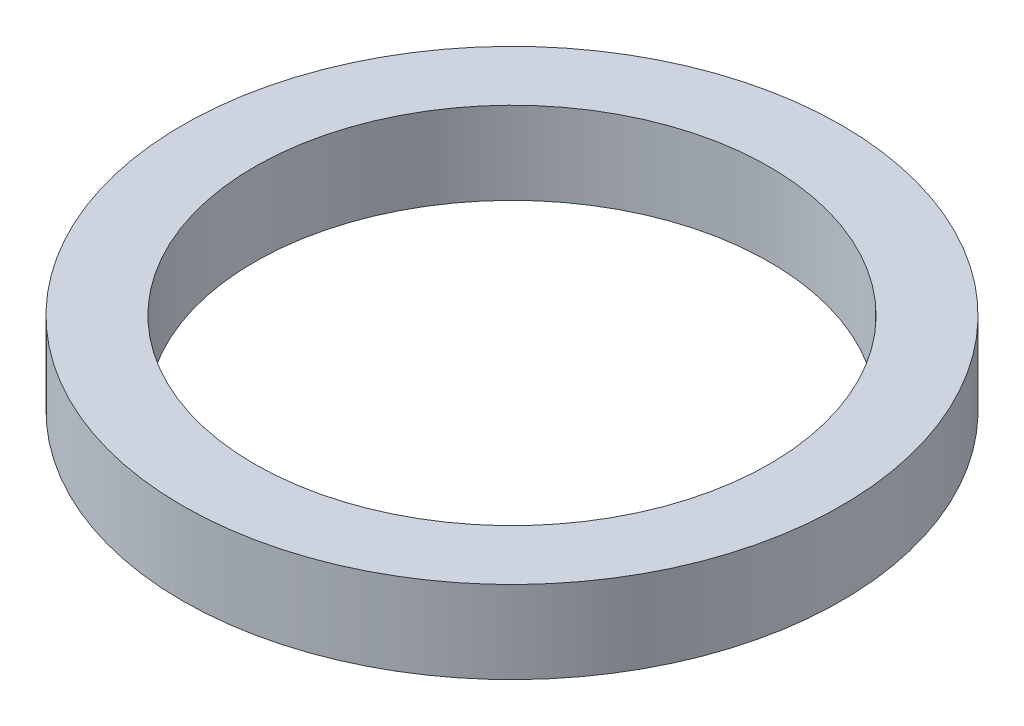
ISO-10303-21;
HEADER;
FILE_DESCRIPTION(('STEP AP214'),'2;1');
FILE_NAME('part.step','',(''),(''),'','','');
FILE_SCHEMA(('AUTOMOTIVE_DESIGN { 1 0 10303 214 1 1 1 1 }'));
ENDSEC;
DATA;
#1=APPLICATION_CONTEXT('core data for automotive mechanical design processes');
#2=APPLICATION_PROTOCOL_DEFINITION('international standard','automotive_design',2000,#1);
#3=PRODUCT_CONTEXT('',#1,'mechanical');
#4=PRODUCT('Part','Part','',(#3));
#5=PRODUCT_RELATED_PRODUCT_CATEGORY('part','',(#4));
#6=PRODUCT_DEFINITION_FORMATION('','',#4);
#7=PRODUCT_DEFINITION_CONTEXT('part definition',#1,'design');
#8=PRODUCT_DEFINITION('design','',#6,#7);
#9=PRODUCT_DEFINITION_SHAPE('','',#8);
#10=(LENGTH_UNIT() NAMED_UNIT(*) SI_UNIT(.MILLI.,.METRE.));
#11=(NAMED_UNIT(*) PLANE_ANGLE_UNIT() SI_UNIT($,.RADIAN.));
#12=(NAMED_UNIT(*) SI_UNIT($,.STERADIAN.) SOLID_ANGLE_UNIT());
#13=UNCERTAINTY_MEASURE_WITH_UNIT(LENGTH_MEASURE(1.E-05),#10,'distance_accuracy_value','');
#14=(GEOMETRIC_REPRESENTATION_CONTEXT(3) GLOBAL_UNCERTAINTY_ASSIGNED_CONTEXT((#13)) GLOBAL_UNIT_ASSIGNED_CONTEXT((#10,
#11,#12)) REPRESENTATION_CONTEXT('',''));
#15=CARTESIAN_POINT('',(0.,0.,0.));
#16=DIRECTION('',(0.,0.,1.));
#17=DIRECTION('',(1.,0.,0.));
#18=AXIS2_PLACEMENT_3D('',#15,#16,#17);
#19=CARTESIAN_POINT('',(0.,4.,0.));
#20=DIRECTION('',(0.,1.,0.));
#21=DIRECTION('',(0.,0.,1.));
#22=AXIS2_PLACEMENT_3D('',#19,#20,#21);
#23=PLANE('',#22);
#24=CARTESIAN_POINT('',(0.,4.,0.));
#25=DIRECTION('',(0.,1.,0.));
#26=DIRECTION('',(0.,0.,1.));
#27=AXIS2_PLACEMENT_3D('',#24,#25,#26);
#28=CIRCLE('',#27,16.);
#29=CARTESIAN_POINT('',(0.,4.,16.));
#30=VERTEX_POINT('',#29);
#31=EDGE_CURVE('E10',#30,#30,#28,.T.);
#32=ORIENTED_EDGE('',*,*,#31,.T.);
#33=EDGE_LOOP('',(#32));
#34=FACE_BOUND('',#33,.T.);
#35=CARTESIAN_POINT('',(0.,4.,0.));
#36=DIRECTION('',(0.,1.,0.));
#37=DIRECTION('',(0.,0.,1.));
#38=AXIS2_PLACEMENT_3D('',#35,#36,#37);
#39=CIRCLE('',#38,12.5);
#40=CARTESIAN_POINT('',(0.,4.,12.5));
#41=VERTEX_POINT('',#40);
#42=EDGE_CURVE('E46',#41,#41,#39,.T.);
#43=ORIENTED_EDGE('',*,*,#42,.F.);
#44=EDGE_LOOP('',(#43));
#45=FACE_BOUND('',#44,.T.);
#46=ADVANCED_FACE('F35',(#34,#45),#23,.T.);
#47=CARTESIAN_POINT('',(0.,0.,0.));
#48=DIRECTION('',(0.,1.,0.));
#49=DIRECTION('',(0.,0.,1.));
#50=AXIS2_PLACEMENT_3D('',#47,#48,#49);
#51=PLANE('',#50);
#52=CARTESIAN_POINT('',(0.,0.,0.));
#53=DIRECTION('',(0.,1.,0.));
#54=DIRECTION('',(0.,0.,1.));
#55=AXIS2_PLACEMENT_3D('',#52,#53,#54);
#56=CIRCLE('',#55,16.);
#57=CARTESIAN_POINT('',(0.,0.,16.));
#58=VERTEX_POINT('',#57);
#59=EDGE_CURVE('E39',#58,#58,#56,.T.);
#60=ORIENTED_EDGE('',*,*,#59,.F.);
#61=EDGE_LOOP('',(#60));
#62=FACE_BOUND('',#61,.T.);
#63=CARTESIAN_POINT('',(0.,0.,0.));
#64=DIRECTION('',(0.,1.,0.));
#65=DIRECTION('',(0.,0.,1.));
#66=AXIS2_PLACEMENT_3D('',#63,#64,#65);
#67=CIRCLE('',#66,12.5);
#68=CARTESIAN_POINT('',(0.,0.,12.5));
#69=VERTEX_POINT('',#68);
#70=EDGE_CURVE('E48',#69,#69,#67,.T.);
#71=ORIENTED_EDGE('',*,*,#70,.T.);
#72=EDGE_LOOP('',(#71));
#73=FACE_BOUND('',#72,.T.);
#74=ADVANCED_FACE('F58',(#62,#73),#51,.F.);
#75=CARTESIAN_POINT('',(0.,4.,0.));
#76=DIRECTION('',(0.,-1.,0.));
#77=DIRECTION('',(0.,0.,-1.));
#78=AXIS2_PLACEMENT_3D('',#75,#76,#77);
#79=CYLINDRICAL_SURFACE('',#78,16.);
#80=ORIENTED_EDGE('',*,*,#31,.F.);
#81=EDGE_LOOP('',(#80));
#82=FACE_BOUND('',#81,.T.);
#83=ORIENTED_EDGE('',*,*,#59,.T.);
#84=EDGE_LOOP('',(#83));
#85=FACE_BOUND('',#84,.T.);
#86=ADVANCED_FACE('F37',(#82,#85),#79,.T.);
#87=CARTESIAN_POINT('',(0.,4.,0.));
#88=DIRECTION('',(0.,-1.,0.));
#89=DIRECTION('',(0.,0.,-1.));
#90=AXIS2_PLACEMENT_3D('',#87,#88,#89);
#91=CYLINDRICAL_SURFACE('',#90,12.5);
#92=ORIENTED_EDGE('',*,*,#42,.T.);
#93=EDGE_LOOP('',(#92));
#94=FACE_BOUND('',#93,.T.);
#95=ORIENTED_EDGE('',*,*,#70,.F.);
#96=EDGE_LOOP('',(#95));
#97=FACE_BOUND('',#96,.T.);
#98=ADVANCED_FACE('F54',(#94,#97),#91,.F.);
#99=CLOSED_SHELL('',(#46,#74,#86,#98));
#100=MANIFOLD_SOLID_BREP('B2',#99);
#101=ADVANCED_BREP_SHAPE_REPRESENTATION('',(#18,#100),#14);
#102=SHAPE_DEFINITION_REPRESENTATION(#9,#101);
ENDSEC;
END-ISO-10303-21;
